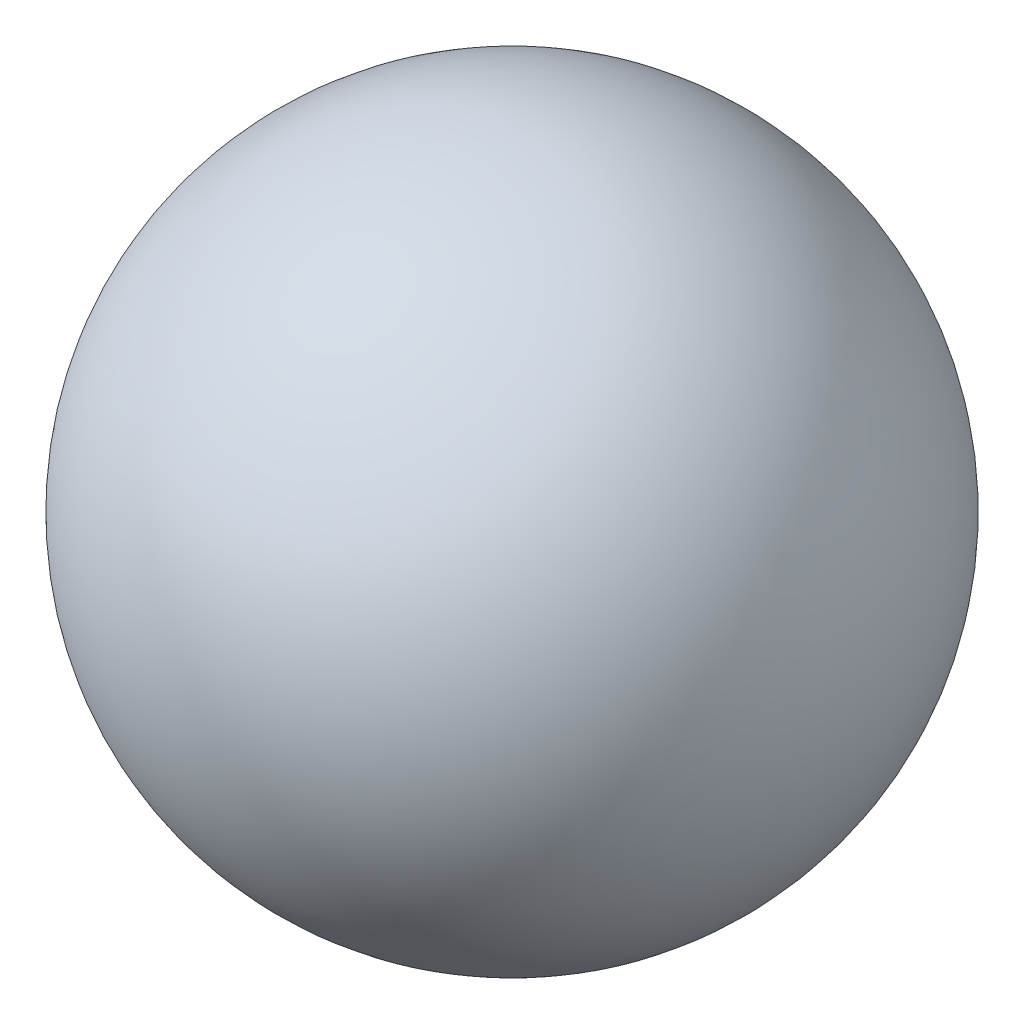
ISO-10303-21;
HEADER;
FILE_DESCRIPTION(('STEP AP214'),'2;1');
FILE_NAME('part.step','',(''),(''),'','','');
FILE_SCHEMA(('AUTOMOTIVE_DESIGN { 1 0 10303 214 1 1 1 1 }'));
ENDSEC;
DATA;
#1=APPLICATION_CONTEXT('core data for automotive mechanical design processes');
#2=APPLICATION_PROTOCOL_DEFINITION('international standard','automotive_design',2000,#1);
#3=PRODUCT_CONTEXT('',#1,'mechanical');
#4=PRODUCT('Part','Part','',(#3));
#5=PRODUCT_RELATED_PRODUCT_CATEGORY('part','',(#4));
#6=PRODUCT_DEFINITION_FORMATION('','',#4);
#7=PRODUCT_DEFINITION_CONTEXT('part definition',#1,'design');
#8=PRODUCT_DEFINITION('design','',#6,#7);
#9=PRODUCT_DEFINITION_SHAPE('','',#8);
#10=(LENGTH_UNIT() NAMED_UNIT(*) SI_UNIT(.MILLI.,.METRE.));
#11=(NAMED_UNIT(*) PLANE_ANGLE_UNIT() SI_UNIT($,.RADIAN.));
#12=(NAMED_UNIT(*) SI_UNIT($,.STERADIAN.) SOLID_ANGLE_UNIT());
#13=UNCERTAINTY_MEASURE_WITH_UNIT(LENGTH_MEASURE(1.E-05),#10,'distance_accuracy_value','');
#14=(GEOMETRIC_REPRESENTATION_CONTEXT(3) GLOBAL_UNCERTAINTY_ASSIGNED_CONTEXT((#13)) GLOBAL_UNIT_ASSIGNED_CONTEXT((#10,
#11,#12)) REPRESENTATION_CONTEXT('',''));
#15=CARTESIAN_POINT('',(0.,0.,0.));
#16=DIRECTION('',(0.,0.,1.));
#17=DIRECTION('',(1.,0.,0.));
#18=AXIS2_PLACEMENT_3D('',#15,#16,#17);
#19=CARTESIAN_POINT('',(0.,0.,0.));
#20=DIRECTION('',(0.,1.,0.));
#21=DIRECTION('',(1.,0.,0.));
#22=AXIS2_PLACEMENT_3D('',#19,#20,#21);
#23=SPHERICAL_SURFACE('',#22,30.);
#24=CARTESIAN_POINT('',(0.,30.,0.));
#25=VERTEX_POINT('',#24);
#26=VERTEX_LOOP('',#25);
#27=FACE_BOUND('',#26,.T.);
#28=ADVANCED_FACE('F29',(#27),#23,.T.);
#29=CLOSED_SHELL('',(#28));
#30=MANIFOLD_SOLID_BREP('B2',#29);
#31=ADVANCED_BREP_SHAPE_REPRESENTATION('',(#18,#30),#14);
#32=SHAPE_DEFINITION_REPRESENTATION(#9,#31);
ENDSEC;
END-ISO-10303-21;
